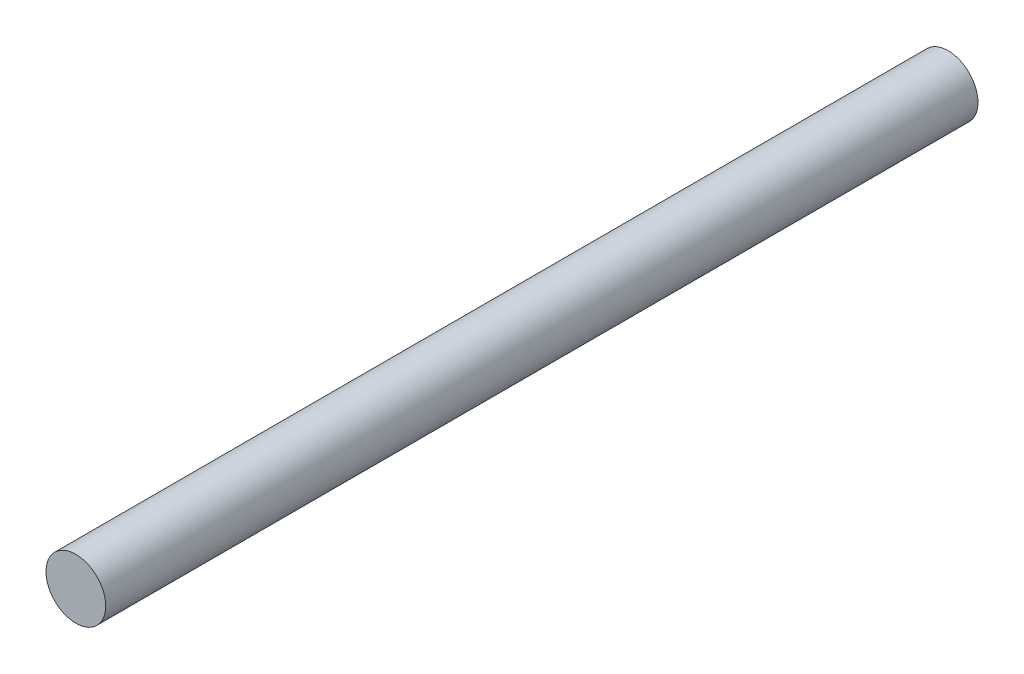
ISO-10303-21;
HEADER;
FILE_DESCRIPTION(('STEP AP214'),'2;1');
FILE_NAME('part.step','',(''),(''),'','','');
FILE_SCHEMA(('AUTOMOTIVE_DESIGN { 1 0 10303 214 1 1 1 1 }'));
ENDSEC;
DATA;
#1=APPLICATION_CONTEXT('core data for automotive mechanical design processes');
#2=APPLICATION_PROTOCOL_DEFINITION('international standard','automotive_design',2000,#1);
#3=PRODUCT_CONTEXT('',#1,'mechanical');
#4=PRODUCT('Part','Part','',(#3));
#5=PRODUCT_RELATED_PRODUCT_CATEGORY('part','',(#4));
#6=PRODUCT_DEFINITION_FORMATION('','',#4);
#7=PRODUCT_DEFINITION_CONTEXT('part definition',#1,'design');
#8=PRODUCT_DEFINITION('design','',#6,#7);
#9=PRODUCT_DEFINITION_SHAPE('','',#8);
#10=(LENGTH_UNIT() NAMED_UNIT(*) SI_UNIT(.MILLI.,.METRE.));
#11=(NAMED_UNIT(*) PLANE_ANGLE_UNIT() SI_UNIT($,.RADIAN.));
#12=(NAMED_UNIT(*) SI_UNIT($,.STERADIAN.) SOLID_ANGLE_UNIT());
#13=UNCERTAINTY_MEASURE_WITH_UNIT(LENGTH_MEASURE(1.E-05),#10,'distance_accuracy_value','');
#14=(GEOMETRIC_REPRESENTATION_CONTEXT(3) GLOBAL_UNCERTAINTY_ASSIGNED_CONTEXT((#13)) GLOBAL_UNIT_ASSIGNED_CONTEXT((#10,
#11,#12)) REPRESENTATION_CONTEXT('',''));
#15=CARTESIAN_POINT('',(0.,0.,0.));
#16=DIRECTION('',(0.,0.,1.));
#17=DIRECTION('',(1.,0.,0.));
#18=AXIS2_PLACEMENT_3D('',#15,#16,#17);
#19=CARTESIAN_POINT('',(0.,0.,73.));
#20=DIRECTION('',(0.,0.,-1.));
#21=DIRECTION('',(-1.,0.,0.));
#22=AXIS2_PLACEMENT_3D('',#19,#20,#21);
#23=CYLINDRICAL_SURFACE('',#22,2.5);
#24=CARTESIAN_POINT('',(0.,0.,73.));
#25=DIRECTION('',(0.,0.,1.));
#26=DIRECTION('',(1.,0.,0.));
#27=AXIS2_PLACEMENT_3D('',#24,#25,#26);
#28=CIRCLE('',#27,2.5);
#29=CARTESIAN_POINT('',(2.5,0.,73.));
#30=VERTEX_POINT('',#29);
#31=EDGE_CURVE('E10',#30,#30,#28,.T.);
#32=ORIENTED_EDGE('',*,*,#31,.F.);
#33=EDGE_LOOP('',(#32));
#34=FACE_BOUND('',#33,.T.);
#35=CARTESIAN_POINT('',(0.,0.,0.));
#36=DIRECTION('',(0.,0.,1.));
#37=DIRECTION('',(1.,0.,0.));
#38=AXIS2_PLACEMENT_3D('',#35,#36,#37);
#39=CIRCLE('',#38,2.5);
#40=CARTESIAN_POINT('',(2.5,0.,0.));
#41=VERTEX_POINT('',#40);
#42=EDGE_CURVE('E38',#41,#41,#39,.T.);
#43=ORIENTED_EDGE('',*,*,#42,.T.);
#44=EDGE_LOOP('',(#43));
#45=FACE_BOUND('',#44,.T.);
#46=ADVANCED_FACE('F35',(#34,#45),#23,.T.);
#47=CARTESIAN_POINT('',(0.,0.,73.));
#48=DIRECTION('',(0.,0.,1.));
#49=DIRECTION('',(1.,0.,0.));
#50=AXIS2_PLACEMENT_3D('',#47,#48,#49);
#51=PLANE('',#50);
#52=ORIENTED_EDGE('',*,*,#31,.T.);
#53=EDGE_LOOP('',(#52));
#54=FACE_BOUND('',#53,.T.);
#55=ADVANCED_FACE('F50',(#54),#51,.T.);
#56=CARTESIAN_POINT('',(0.,0.,0.));
#57=DIRECTION('',(0.,0.,1.));
#58=DIRECTION('',(1.,0.,0.));
#59=AXIS2_PLACEMENT_3D('',#56,#57,#58);
#60=PLANE('',#59);
#61=ORIENTED_EDGE('',*,*,#42,.F.);
#62=EDGE_LOOP('',(#61));
#63=FACE_BOUND('',#62,.T.);
#64=ADVANCED_FACE('F48',(#63),#60,.F.);
#65=CLOSED_SHELL('',(#46,#55,#64));
#66=MANIFOLD_SOLID_BREP('B2',#65);
#67=ADVANCED_BREP_SHAPE_REPRESENTATION('',(#18,#66),#14);
#68=SHAPE_DEFINITION_REPRESENTATION(#9,#67);
ENDSEC;
END-ISO-10303-21;
